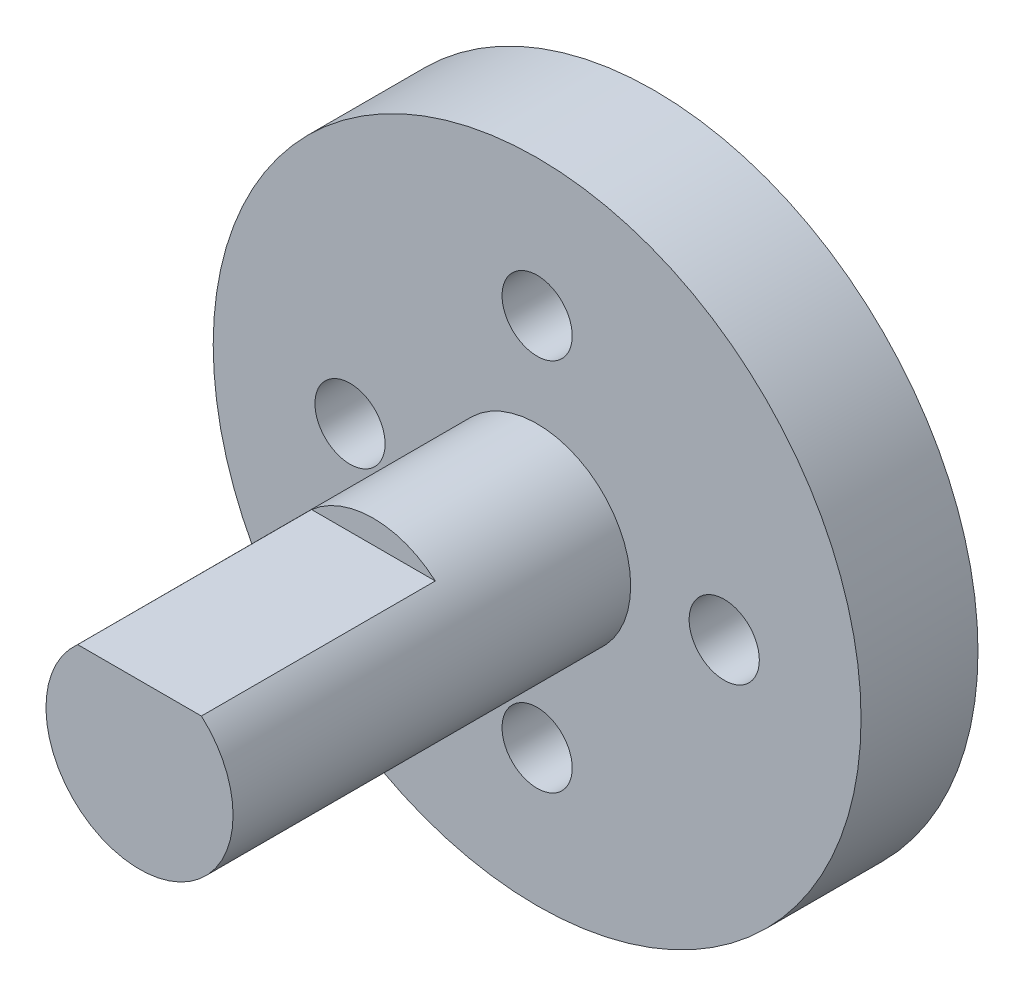
ISO-10303-21;
HEADER;
FILE_DESCRIPTION(('STEP AP214'),'2;1');
FILE_NAME('part.step','',(''),(''),'','','');
FILE_SCHEMA(('AUTOMOTIVE_DESIGN { 1 0 10303 214 1 1 1 1 }'));
ENDSEC;
DATA;
#1=APPLICATION_CONTEXT('core data for automotive mechanical design processes');
#2=APPLICATION_PROTOCOL_DEFINITION('international standard','automotive_design',2000,#1);
#3=PRODUCT_CONTEXT('',#1,'mechanical');
#4=PRODUCT('Part','Part','',(#3));
#5=PRODUCT_RELATED_PRODUCT_CATEGORY('part','',(#4));
#6=PRODUCT_DEFINITION_FORMATION('','',#4);
#7=PRODUCT_DEFINITION_CONTEXT('part definition',#1,'design');
#8=PRODUCT_DEFINITION('design','',#6,#7);
#9=PRODUCT_DEFINITION_SHAPE('','',#8);
#10=(LENGTH_UNIT() NAMED_UNIT(*) SI_UNIT(.MILLI.,.METRE.));
#11=(NAMED_UNIT(*) PLANE_ANGLE_UNIT() SI_UNIT($,.RADIAN.));
#12=(NAMED_UNIT(*) SI_UNIT($,.STERADIAN.) SOLID_ANGLE_UNIT());
#13=UNCERTAINTY_MEASURE_WITH_UNIT(LENGTH_MEASURE(1.E-05),#10,'distance_accuracy_value','');
#14=(GEOMETRIC_REPRESENTATION_CONTEXT(3) GLOBAL_UNCERTAINTY_ASSIGNED_CONTEXT((#13)) GLOBAL_UNIT_ASSIGNED_CONTEXT((#10,
#11,#12)) REPRESENTATION_CONTEXT('',''));
#15=CARTESIAN_POINT('',(0.,0.,0.));
#16=DIRECTION('',(0.,0.,1.));
#17=DIRECTION('',(1.,0.,0.));
#18=AXIS2_PLACEMENT_3D('',#15,#16,#17);
#19=CARTESIAN_POINT('',(0.,0.,5.));
#20=DIRECTION('',(0.,0.,1.));
#21=DIRECTION('',(1.,0.,0.));
#22=AXIS2_PLACEMENT_3D('',#19,#20,#21);
#23=PLANE('',#22);
#24=CARTESIAN_POINT('',(8.00000000000001,0.,5.));
#25=DIRECTION('',(0.,0.,1.));
#26=DIRECTION('',(1.,0.,0.));
#27=AXIS2_PLACEMENT_3D('',#24,#25,#26);
#28=CIRCLE('',#27,1.5);
#29=CARTESIAN_POINT('',(9.50000000000001,0.,5.));
#30=VERTEX_POINT('',#29);
#31=EDGE_CURVE('E87',#30,#30,#28,.T.);
#32=ORIENTED_EDGE('',*,*,#31,.F.);
#33=EDGE_LOOP('',(#32));
#34=FACE_BOUND('',#33,.T.);
#35=CARTESIAN_POINT('',(0.,8.00000000000006,5.));
#36=DIRECTION('',(0.,0.,1.));
#37=DIRECTION('',(1.,0.,0.));
#38=AXIS2_PLACEMENT_3D('',#35,#36,#37);
#39=CIRCLE('',#38,1.5);
#40=CARTESIAN_POINT('',(1.5,8.00000000000006,5.));
#41=VERTEX_POINT('',#40);
#42=EDGE_CURVE('E99',#41,#41,#39,.T.);
#43=ORIENTED_EDGE('',*,*,#42,.F.);
#44=EDGE_LOOP('',(#43));
#45=FACE_BOUND('',#44,.T.);
#46=CARTESIAN_POINT('',(0.,0.,5.));
#47=DIRECTION('',(0.,0.,1.));
#48=DIRECTION('',(1.,0.,0.));
#49=AXIS2_PLACEMENT_3D('',#46,#47,#48);
#50=CIRCLE('',#49,13.85);
#51=CARTESIAN_POINT('',(13.85,0.,5.));
#52=VERTEX_POINT('',#51);
#53=EDGE_CURVE('E11',#52,#52,#50,.T.);
#54=ORIENTED_EDGE('',*,*,#53,.T.);
#55=EDGE_LOOP('',(#54));
#56=FACE_BOUND('',#55,.T.);
#57=CARTESIAN_POINT('',(0.,0.,5.));
#58=DIRECTION('',(0.,0.,1.));
#59=DIRECTION('',(1.,0.,0.));
#60=AXIS2_PLACEMENT_3D('',#57,#58,#59);
#61=CIRCLE('',#60,4.00000000000002);
#62=CARTESIAN_POINT('',(4.00000000000002,0.,5.));
#63=VERTEX_POINT('',#62);
#64=EDGE_CURVE('E102',#63,#63,#61,.T.);
#65=ORIENTED_EDGE('',*,*,#64,.F.);
#66=EDGE_LOOP('',(#65));
#67=FACE_BOUND('',#66,.T.);
#68=CARTESIAN_POINT('',(-8.00000000000001,0.,5.));
#69=DIRECTION('',(0.,0.,1.));
#70=DIRECTION('',(1.,0.,0.));
#71=AXIS2_PLACEMENT_3D('',#68,#69,#70);
#72=CIRCLE('',#71,1.5);
#73=CARTESIAN_POINT('',(-6.50000000000001,0.,5.));
#74=VERTEX_POINT('',#73);
#75=EDGE_CURVE('E93',#74,#74,#72,.T.);
#76=ORIENTED_EDGE('',*,*,#75,.F.);
#77=EDGE_LOOP('',(#76));
#78=FACE_BOUND('',#77,.T.);
#79=CARTESIAN_POINT('',(0.,-7.99999999999995,5.));
#80=DIRECTION('',(0.,0.,1.));
#81=DIRECTION('',(1.,0.,0.));
#82=AXIS2_PLACEMENT_3D('',#79,#80,#81);
#83=CIRCLE('',#82,1.5);
#84=CARTESIAN_POINT('',(1.5,-7.99999999999995,5.));
#85=VERTEX_POINT('',#84);
#86=EDGE_CURVE('E80',#85,#85,#83,.T.);
#87=ORIENTED_EDGE('',*,*,#86,.F.);
#88=EDGE_LOOP('',(#87));
#89=FACE_BOUND('',#88,.T.);
#90=ADVANCED_FACE('F37',(#34,#45,#56,#67,#78,#89),#23,.T.);
#91=CARTESIAN_POINT('',(0.,0.,0.));
#92=DIRECTION('',(0.,0.,1.));
#93=DIRECTION('',(1.,0.,0.));
#94=AXIS2_PLACEMENT_3D('',#91,#92,#93);
#95=PLANE('',#94);
#96=CARTESIAN_POINT('',(0.,0.,0.));
#97=DIRECTION('',(0.,0.,1.));
#98=DIRECTION('',(1.,0.,0.));
#99=AXIS2_PLACEMENT_3D('',#96,#97,#98);
#100=CIRCLE('',#99,13.85);
#101=CARTESIAN_POINT('',(13.85,0.,0.));
#102=VERTEX_POINT('',#101);
#103=EDGE_CURVE('E41',#102,#102,#100,.T.);
#104=ORIENTED_EDGE('',*,*,#103,.F.);
#105=EDGE_LOOP('',(#104));
#106=FACE_BOUND('',#105,.T.);
#107=CARTESIAN_POINT('',(0.,8.00000000000006,0.));
#108=DIRECTION('',(0.,0.,1.));
#109=DIRECTION('',(1.,0.,0.));
#110=AXIS2_PLACEMENT_3D('',#107,#108,#109);
#111=CIRCLE('',#110,1.5);
#112=CARTESIAN_POINT('',(1.5,8.00000000000006,0.));
#113=VERTEX_POINT('',#112);
#114=EDGE_CURVE('E96',#113,#113,#111,.T.);
#115=ORIENTED_EDGE('',*,*,#114,.T.);
#116=EDGE_LOOP('',(#115));
#117=FACE_BOUND('',#116,.T.);
#118=CARTESIAN_POINT('',(-8.00000000000001,0.,0.));
#119=DIRECTION('',(0.,0.,1.));
#120=DIRECTION('',(1.,0.,0.));
#121=AXIS2_PLACEMENT_3D('',#118,#119,#120);
#122=CIRCLE('',#121,1.5);
#123=CARTESIAN_POINT('',(-6.50000000000001,0.,0.));
#124=VERTEX_POINT('',#123);
#125=EDGE_CURVE('E90',#124,#124,#122,.T.);
#126=ORIENTED_EDGE('',*,*,#125,.T.);
#127=EDGE_LOOP('',(#126));
#128=FACE_BOUND('',#127,.T.);
#129=CARTESIAN_POINT('',(8.00000000000001,0.,0.));
#130=DIRECTION('',(0.,0.,1.));
#131=DIRECTION('',(1.,0.,0.));
#132=AXIS2_PLACEMENT_3D('',#129,#130,#131);
#133=CIRCLE('',#132,1.5);
#134=CARTESIAN_POINT('',(9.50000000000001,0.,0.));
#135=VERTEX_POINT('',#134);
#136=EDGE_CURVE('E85',#135,#135,#133,.T.);
#137=ORIENTED_EDGE('',*,*,#136,.T.);
#138=EDGE_LOOP('',(#137));
#139=FACE_BOUND('',#138,.T.);
#140=CARTESIAN_POINT('',(0.,-7.99999999999995,0.));
#141=DIRECTION('',(0.,0.,1.));
#142=DIRECTION('',(1.,0.,0.));
#143=AXIS2_PLACEMENT_3D('',#140,#141,#142);
#144=CIRCLE('',#143,1.5);
#145=CARTESIAN_POINT('',(1.5,-7.99999999999995,0.));
#146=VERTEX_POINT('',#145);
#147=EDGE_CURVE('E77',#146,#146,#144,.T.);
#148=ORIENTED_EDGE('',*,*,#147,.T.);
#149=EDGE_LOOP('',(#148));
#150=FACE_BOUND('',#149,.T.);
#151=ADVANCED_FACE('F111',(#106,#117,#128,#139,#150),#95,.F.);
#152=CARTESIAN_POINT('',(0.,0.,5.));
#153=DIRECTION('',(0.,0.,-1.));
#154=DIRECTION('',(-1.,0.,0.));
#155=AXIS2_PLACEMENT_3D('',#152,#153,#154);
#156=CYLINDRICAL_SURFACE('',#155,13.85);
#157=ORIENTED_EDGE('',*,*,#53,.F.);
#158=EDGE_LOOP('',(#157));
#159=FACE_BOUND('',#158,.T.);
#160=ORIENTED_EDGE('',*,*,#103,.T.);
#161=EDGE_LOOP('',(#160));
#162=FACE_BOUND('',#161,.T.);
#163=ADVANCED_FACE('F39',(#159,#162),#156,.T.);
#164=CARTESIAN_POINT('',(0.,8.00000000000006,5.));
#165=DIRECTION('',(0.,0.,-1.));
#166=DIRECTION('',(-1.,0.,0.));
#167=AXIS2_PLACEMENT_3D('',#164,#165,#166);
#168=CYLINDRICAL_SURFACE('',#167,1.5);
#169=ORIENTED_EDGE('',*,*,#42,.T.);
#170=EDGE_LOOP('',(#169));
#171=FACE_BOUND('',#170,.T.);
#172=ORIENTED_EDGE('',*,*,#114,.F.);
#173=EDGE_LOOP('',(#172));
#174=FACE_BOUND('',#173,.T.);
#175=ADVANCED_FACE('F143',(#171,#174),#168,.F.);
#176=CARTESIAN_POINT('',(-8.00000000000001,0.,5.));
#177=DIRECTION('',(0.,0.,-1.));
#178=DIRECTION('',(-1.,0.,0.));
#179=AXIS2_PLACEMENT_3D('',#176,#177,#178);
#180=CYLINDRICAL_SURFACE('',#179,1.5);
#181=ORIENTED_EDGE('',*,*,#75,.T.);
#182=EDGE_LOOP('',(#181));
#183=FACE_BOUND('',#182,.T.);
#184=ORIENTED_EDGE('',*,*,#125,.F.);
#185=EDGE_LOOP('',(#184));
#186=FACE_BOUND('',#185,.T.);
#187=ADVANCED_FACE('F132',(#183,#186),#180,.F.);
#188=CARTESIAN_POINT('',(8.00000000000001,0.,5.));
#189=DIRECTION('',(0.,0.,-1.));
#190=DIRECTION('',(-1.,0.,0.));
#191=AXIS2_PLACEMENT_3D('',#188,#189,#190);
#192=CYLINDRICAL_SURFACE('',#191,1.5);
#193=ORIENTED_EDGE('',*,*,#31,.T.);
#194=EDGE_LOOP('',(#193));
#195=FACE_BOUND('',#194,.T.);
#196=ORIENTED_EDGE('',*,*,#136,.F.);
#197=EDGE_LOOP('',(#196));
#198=FACE_BOUND('',#197,.T.);
#199=ADVANCED_FACE('F124',(#195,#198),#192,.F.);
#200=CARTESIAN_POINT('',(0.,-7.99999999999995,5.));
#201=DIRECTION('',(0.,0.,-1.));
#202=DIRECTION('',(-1.,0.,0.));
#203=AXIS2_PLACEMENT_3D('',#200,#201,#202);
#204=CYLINDRICAL_SURFACE('',#203,1.5);
#205=ORIENTED_EDGE('',*,*,#86,.T.);
#206=EDGE_LOOP('',(#205));
#207=FACE_BOUND('',#206,.T.);
#208=ORIENTED_EDGE('',*,*,#147,.F.);
#209=EDGE_LOOP('',(#208));
#210=FACE_BOUND('',#209,.T.);
#211=ADVANCED_FACE('F122',(#207,#210),#204,.F.);
#212=CARTESIAN_POINT('',(0.,0.,0.));
#213=DIRECTION('',(0.,0.,1.));
#214=DIRECTION('',(1.,0.,0.));
#215=AXIS2_PLACEMENT_3D('',#212,#213,#214);
#216=CYLINDRICAL_SURFACE('',#215,4.00000000000002);
#217=DIRECTION('',(0.,0.,1.));
#218=VECTOR('',#217,1.);
#219=CARTESIAN_POINT('',(2.6457513110646,3.00000000000002,12.));
#220=LINE('',#219,#218);
#221=CARTESIAN_POINT('',(2.6457513110646,3.00000000000002,12.));
#222=VERTEX_POINT('',#221);
#223=CARTESIAN_POINT('',(2.6457513110646,3.00000000000002,22.));
#224=VERTEX_POINT('',#223);
#225=EDGE_CURVE('E58',#222,#224,#220,.T.);
#226=ORIENTED_EDGE('',*,*,#225,.T.);
#227=CARTESIAN_POINT('',(0.,0.,22.));
#228=DIRECTION('',(0.,0.,1.));
#229=DIRECTION('',(1.,0.,0.));
#230=AXIS2_PLACEMENT_3D('',#227,#228,#229);
#231=CIRCLE('',#230,4.00000000000002);
#232=CARTESIAN_POINT('',(-2.6457513110646,3.00000000000002,22.));
#233=VERTEX_POINT('',#232);
#234=EDGE_CURVE('E74',#233,#224,#231,.T.);
#235=ORIENTED_EDGE('',*,*,#234,.F.);
#236=DIRECTION('',(0.,0.,1.));
#237=VECTOR('',#236,1.);
#238=CARTESIAN_POINT('',(-2.6457513110646,3.00000000000002,12.));
#239=LINE('',#238,#237);
#240=CARTESIAN_POINT('',(-2.6457513110646,3.00000000000002,12.));
#241=VERTEX_POINT('',#240);
#242=EDGE_CURVE('E52',#241,#233,#239,.T.);
#243=ORIENTED_EDGE('',*,*,#242,.F.);
#244=CARTESIAN_POINT('',(0.,0.,12.));
#245=DIRECTION('',(0.,0.,1.));
#246=DIRECTION('',(1.,0.,0.));
#247=AXIS2_PLACEMENT_3D('',#244,#245,#246);
#248=CIRCLE('',#247,4.00000000000002);
#249=EDGE_CURVE('E68',#222,#241,#248,.T.);
#250=ORIENTED_EDGE('',*,*,#249,.F.);
#251=EDGE_LOOP('',(#226,#235,#243,#250));
#252=FACE_BOUND('',#251,.T.);
#253=ORIENTED_EDGE('',*,*,#64,.T.);
#254=EDGE_LOOP('',(#253));
#255=FACE_BOUND('',#254,.T.);
#256=ADVANCED_FACE('F72',(#252,#255),#216,.T.);
#257=CARTESIAN_POINT('',(0.,0.,22.));
#258=DIRECTION('',(0.,0.,1.));
#259=DIRECTION('',(1.,0.,0.));
#260=AXIS2_PLACEMENT_3D('',#257,#258,#259);
#261=PLANE('',#260);
#262=DIRECTION('',(1.,0.,0.));
#263=VECTOR('',#262,1.);
#264=CARTESIAN_POINT('',(-2.6457513110646,3.00000000000002,22.));
#265=LINE('',#264,#263);
#266=EDGE_CURVE('E63',#233,#224,#265,.T.);
#267=ORIENTED_EDGE('',*,*,#266,.F.);
#268=ORIENTED_EDGE('',*,*,#234,.T.);
#269=EDGE_LOOP('',(#267,#268));
#270=FACE_BOUND('',#269,.T.);
#271=ADVANCED_FACE('F76',(#270),#261,.T.);
#272=CARTESIAN_POINT('',(-2.6457513110646,3.00000000000002,12.));
#273=DIRECTION('',(0.,-1.,0.));
#274=DIRECTION('',(0.,0.,-1.));
#275=AXIS2_PLACEMENT_3D('',#272,#273,#274);
#276=PLANE('',#275);
#277=ORIENTED_EDGE('',*,*,#266,.T.);
#278=ORIENTED_EDGE('',*,*,#225,.F.);
#279=DIRECTION('',(1.,0.,0.));
#280=VECTOR('',#279,1.);
#281=CARTESIAN_POINT('',(-2.6457513110646,3.00000000000002,12.));
#282=LINE('',#281,#280);
#283=EDGE_CURVE('E210',#241,#222,#282,.T.);
#284=ORIENTED_EDGE('',*,*,#283,.F.);
#285=ORIENTED_EDGE('',*,*,#242,.T.);
#286=EDGE_LOOP('',(#277,#278,#284,#285));
#287=FACE_BOUND('',#286,.T.);
#288=ADVANCED_FACE('F64',(#287),#276,.F.);
#289=CARTESIAN_POINT('',(0.,0.,12.));
#290=DIRECTION('',(0.,0.,1.));
#291=DIRECTION('',(1.,0.,0.));
#292=AXIS2_PLACEMENT_3D('',#289,#290,#291);
#293=PLANE('',#292);
#294=ORIENTED_EDGE('',*,*,#249,.T.);
#295=ORIENTED_EDGE('',*,*,#283,.T.);
#296=EDGE_LOOP('',(#294,#295));
#297=FACE_BOUND('',#296,.T.);
#298=ADVANCED_FACE('F197',(#297),#293,.T.);
#299=CLOSED_SHELL('',(#90,#151,#163,#175,#187,#199,#211,#256,#271,#288,#298));
#300=MANIFOLD_SOLID_BREP('B2',#299);
#301=ADVANCED_BREP_SHAPE_REPRESENTATION('',(#18,#300),#14);
#302=SHAPE_DEFINITION_REPRESENTATION(#9,#301);
ENDSEC;
END-ISO-10303-21;
